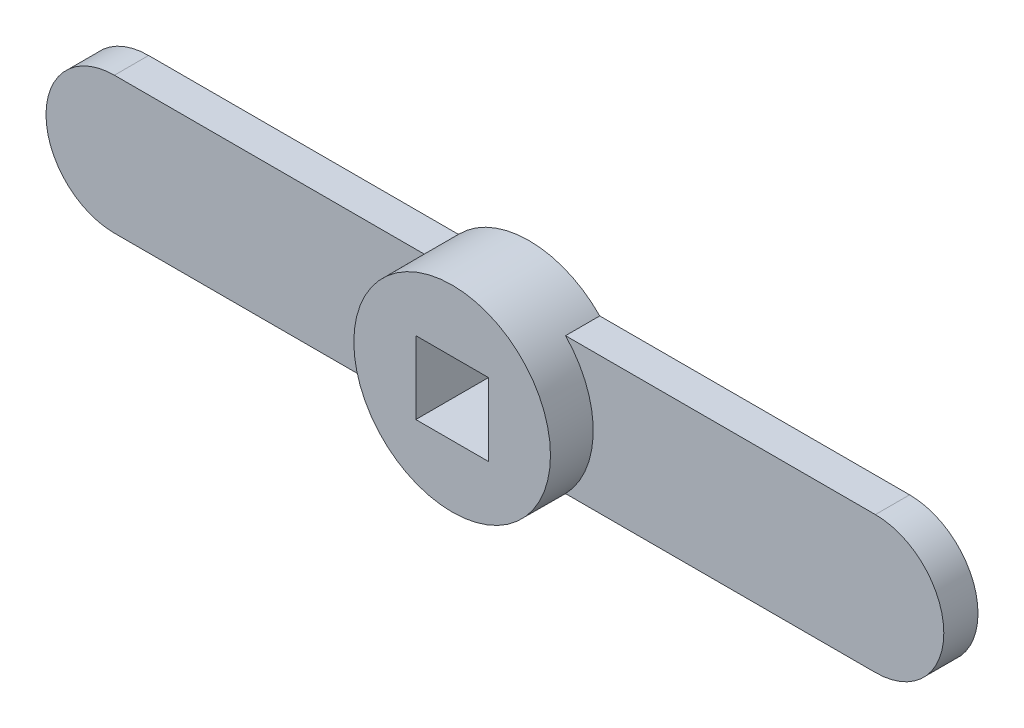
ISO-10303-21;
HEADER;
FILE_DESCRIPTION(('STEP AP214'),'2;1');
FILE_NAME('part.step','',(''),(''),'','','');
FILE_SCHEMA(('AUTOMOTIVE_DESIGN { 1 0 10303 214 1 1 1 1 }'));
ENDSEC;
DATA;
#1=APPLICATION_CONTEXT('core data for automotive mechanical design processes');
#2=APPLICATION_PROTOCOL_DEFINITION('international standard','automotive_design',2000,#1);
#3=PRODUCT_CONTEXT('',#1,'mechanical');
#4=PRODUCT('Part','Part','',(#3));
#5=PRODUCT_RELATED_PRODUCT_CATEGORY('part','',(#4));
#6=PRODUCT_DEFINITION_FORMATION('','',#4);
#7=PRODUCT_DEFINITION_CONTEXT('part definition',#1,'design');
#8=PRODUCT_DEFINITION('design','',#6,#7);
#9=PRODUCT_DEFINITION_SHAPE('','',#8);
#10=(LENGTH_UNIT() NAMED_UNIT(*) SI_UNIT(.MILLI.,.METRE.));
#11=(NAMED_UNIT(*) PLANE_ANGLE_UNIT() SI_UNIT($,.RADIAN.));
#12=(NAMED_UNIT(*) SI_UNIT($,.STERADIAN.) SOLID_ANGLE_UNIT());
#13=UNCERTAINTY_MEASURE_WITH_UNIT(LENGTH_MEASURE(1.E-05),#10,'distance_accuracy_value','');
#14=(GEOMETRIC_REPRESENTATION_CONTEXT(3) GLOBAL_UNCERTAINTY_ASSIGNED_CONTEXT((#13)) GLOBAL_UNIT_ASSIGNED_CONTEXT((#10,
#11,#12)) REPRESENTATION_CONTEXT('',''));
#15=CARTESIAN_POINT('',(0.,0.,0.));
#16=DIRECTION('',(0.,0.,1.));
#17=DIRECTION('',(1.,0.,0.));
#18=AXIS2_PLACEMENT_3D('',#15,#16,#17);
#19=CARTESIAN_POINT('',(-44.5000000000006,-8.00000000000008,4.));
#20=DIRECTION('',(0.,1.00000000000002,0.));
#21=DIRECTION('',(0.,0.,1.));
#22=AXIS2_PLACEMENT_3D('',#19,#20,#21);
#23=PLANE('',#22);
#24=DIRECTION('',(1.00000000000002,0.,0.));
#25=VECTOR('',#24,1.);
#26=CARTESIAN_POINT('',(-44.5000000000006,-8.00000000000008,4.));
#27=LINE('',#26,#25);
#28=CARTESIAN_POINT('',(8.26135582092915,-8.00000000000007,4.));
#29=VERTEX_POINT('',#28);
#30=CARTESIAN_POINT('',(44.5000000000007,-8.00000000000008,4.));
#31=VERTEX_POINT('',#30);
#32=EDGE_CURVE('E196',#29,#31,#27,.T.);
#33=ORIENTED_EDGE('',*,*,#32,.F.);
#34=DIRECTION('',(0.,0.,-1.));
#35=VECTOR('',#34,1.);
#36=CARTESIAN_POINT('',(8.26135582092915,-8.00000000000007,8.99999999999999));
#37=LINE('',#36,#35);
#38=CARTESIAN_POINT('',(8.26135582092916,-8.00000000000015,0.));
#39=VERTEX_POINT('',#38);
#40=EDGE_CURVE('E186',#29,#39,#37,.T.);
#41=ORIENTED_EDGE('',*,*,#40,.T.);
#42=DIRECTION('',(1.00000000000002,0.,0.));
#43=VECTOR('',#42,1.);
#44=CARTESIAN_POINT('',(-44.5000000000007,-8.00000000000015,0.));
#45=LINE('',#44,#43);
#46=CARTESIAN_POINT('',(44.5000000000001,-8.00000000000014,0.));
#47=VERTEX_POINT('',#46);
#48=EDGE_CURVE('E209',#39,#47,#45,.T.);
#49=ORIENTED_EDGE('',*,*,#48,.T.);
#50=DIRECTION('',(0.,0.,-1.));
#51=VECTOR('',#50,1.);
#52=CARTESIAN_POINT('',(44.5000000000007,-8.00000000000008,4.));
#53=LINE('',#52,#51);
#54=EDGE_CURVE('E55',#31,#47,#53,.T.);
#55=ORIENTED_EDGE('',*,*,#54,.F.);
#56=EDGE_LOOP('',(#33,#41,#49,#55));
#57=FACE_BOUND('',#56,.T.);
#58=ADVANCED_FACE('F47',(#57),#23,.F.);
#59=CARTESIAN_POINT('',(-44.5000000000006,8.00000000000023,3.99999999999935));
#60=DIRECTION('',(0.,-1.00000000000002,0.));
#61=DIRECTION('',(0.,0.,-1.));
#62=AXIS2_PLACEMENT_3D('',#59,#60,#61);
#63=PLANE('',#62);
#64=DIRECTION('',(-1.00000000000002,0.,0.));
#65=VECTOR('',#64,1.);
#66=CARTESIAN_POINT('',(-44.5000000000006,8.00000000000023,3.99999999999935));
#67=LINE('',#66,#65);
#68=CARTESIAN_POINT('',(-8.26135582092946,8.00000000000024,4.));
#69=VERTEX_POINT('',#68);
#70=CARTESIAN_POINT('',(-44.5000000000006,8.00000000000023,3.99999999999935));
#71=VERTEX_POINT('',#70);
#72=EDGE_CURVE('E203',#69,#71,#67,.T.);
#73=ORIENTED_EDGE('',*,*,#72,.F.);
#74=DIRECTION('',(0.,0.,-1.));
#75=VECTOR('',#74,1.);
#76=CARTESIAN_POINT('',(-8.26135582092948,8.00000000000025,9.00000000000001));
#77=LINE('',#76,#75);
#78=CARTESIAN_POINT('',(-8.26135582092946,8.00000000000016,0.));
#79=VERTEX_POINT('',#78);
#80=EDGE_CURVE('E188',#69,#79,#77,.T.);
#81=ORIENTED_EDGE('',*,*,#80,.T.);
#82=DIRECTION('',(-1.00000000000002,0.,0.));
#83=VECTOR('',#82,1.);
#84=CARTESIAN_POINT('',(-44.5000000000006,8.00000000000016,-6.24500451351651E-13));
#85=LINE('',#84,#83);
#86=CARTESIAN_POINT('',(-44.5000000000006,8.00000000000016,-6.24500451351651E-13));
#87=VERTEX_POINT('',#86);
#88=EDGE_CURVE('E214',#79,#87,#85,.T.);
#89=ORIENTED_EDGE('',*,*,#88,.T.);
#90=DIRECTION('',(0.,0.,-1.));
#91=VECTOR('',#90,1.);
#92=CARTESIAN_POINT('',(-44.5000000000006,8.00000000000023,3.99999999999935));
#93=LINE('',#92,#91);
#94=EDGE_CURVE('E206',#71,#87,#93,.T.);
#95=ORIENTED_EDGE('',*,*,#94,.F.);
#96=EDGE_LOOP('',(#73,#81,#89,#95));
#97=FACE_BOUND('',#96,.T.);
#98=ADVANCED_FACE('F249',(#97),#63,.F.);
#99=CARTESIAN_POINT('',(-44.5000000000006,0.,4.));
#100=DIRECTION('',(0.,0.,1.));
#101=DIRECTION('',(1.00000000000002,0.,0.));
#102=AXIS2_PLACEMENT_3D('',#99,#100,#101);
#103=PLANE('',#102);
#104=CARTESIAN_POINT('',(0.,0.,4.));
#105=DIRECTION('',(0.,0.,1.));
#106=DIRECTION('',(1.00000000000002,0.,0.));
#107=AXIS2_PLACEMENT_3D('',#104,#105,#106);
#108=CIRCLE('',#107,11.5);
#109=CARTESIAN_POINT('',(-8.26135582092946,-8.00000000000007,3.99999999999999));
#110=VERTEX_POINT('',#109);
#111=EDGE_CURVE('E183',#69,#110,#108,.T.);
#112=ORIENTED_EDGE('',*,*,#111,.F.);
#113=ORIENTED_EDGE('',*,*,#72,.T.);
#114=CARTESIAN_POINT('',(-44.5000000000006,0.,4.));
#115=DIRECTION('',(0.,0.,1.));
#116=DIRECTION('',(1.00000000000002,0.,0.));
#117=AXIS2_PLACEMENT_3D('',#114,#115,#116);
#118=CIRCLE('',#117,8.);
#119=CARTESIAN_POINT('',(-44.5000000000006,-8.00000000000008,4.));
#120=VERTEX_POINT('',#119);
#121=EDGE_CURVE('E193',#71,#120,#118,.T.);
#122=ORIENTED_EDGE('',*,*,#121,.T.);
#123=EDGE_CURVE('E198',#120,#110,#27,.T.);
#124=ORIENTED_EDGE('',*,*,#123,.T.);
#125=EDGE_LOOP('',(#112,#113,#122,#124));
#126=FACE_BOUND('',#125,.T.);
#127=ADVANCED_FACE('F254',(#126),#103,.T.);
#128=CARTESIAN_POINT('',(-44.5000000000006,0.,4.));
#129=DIRECTION('',(0.,0.,-1.));
#130=DIRECTION('',(-1.00000000000002,0.,0.));
#131=AXIS2_PLACEMENT_3D('',#128,#129,#130);
#132=CYLINDRICAL_SURFACE('',#131,8.);
#133=CARTESIAN_POINT('',(-44.5000000000007,0.,0.));
#134=DIRECTION('',(0.,0.,1.));
#135=DIRECTION('',(1.00000000000002,0.,0.));
#136=AXIS2_PLACEMENT_3D('',#133,#134,#135);
#137=CIRCLE('',#136,8.);
#138=CARTESIAN_POINT('',(-44.5000000000007,-8.00000000000015,0.));
#139=VERTEX_POINT('',#138);
#140=EDGE_CURVE('E192',#87,#139,#137,.T.);
#141=ORIENTED_EDGE('',*,*,#140,.T.);
#142=DIRECTION('',(0.,0.,-1.));
#143=VECTOR('',#142,1.);
#144=CARTESIAN_POINT('',(-44.5000000000006,-8.00000000000008,4.));
#145=LINE('',#144,#143);
#146=EDGE_CURVE('E13',#120,#139,#145,.T.);
#147=ORIENTED_EDGE('',*,*,#146,.F.);
#148=ORIENTED_EDGE('',*,*,#121,.F.);
#149=ORIENTED_EDGE('',*,*,#94,.T.);
#150=EDGE_LOOP('',(#141,#147,#148,#149));
#151=FACE_BOUND('',#150,.T.);
#152=ADVANCED_FACE('F49',(#151),#132,.T.);
#153=CARTESIAN_POINT('',(-8.26135582092946,-8.00000000000015,0.));
#154=VERTEX_POINT('',#153);
#155=EDGE_CURVE('E210',#139,#154,#45,.T.);
#156=ORIENTED_EDGE('',*,*,#155,.T.);
#157=DIRECTION('',(0.,0.,-1.));
#158=VECTOR('',#157,1.);
#159=CARTESIAN_POINT('',(-8.26135582092948,-8.00000000000007,8.99999999999999));
#160=LINE('',#159,#158);
#161=EDGE_CURVE('E190',#154,#110,#160,.F.);
#162=ORIENTED_EDGE('',*,*,#161,.T.);
#163=ORIENTED_EDGE('',*,*,#123,.F.);
#164=ORIENTED_EDGE('',*,*,#146,.T.);
#165=EDGE_LOOP('',(#156,#162,#163,#164));
#166=FACE_BOUND('',#165,.T.);
#167=ADVANCED_FACE('F250',(#166),#23,.F.);
#168=CARTESIAN_POINT('',(44.5000000000007,0.,3.99999999999938));
#169=DIRECTION('',(0.,0.,-1.));
#170=DIRECTION('',(-1.00000000000002,0.,0.));
#171=AXIS2_PLACEMENT_3D('',#168,#169,#170);
#172=CYLINDRICAL_SURFACE('',#171,8.);
#173=CARTESIAN_POINT('',(44.5000000000001,0.,-6.24500451351651E-13));
#174=DIRECTION('',(0.,0.,1.));
#175=DIRECTION('',(1.00000000000002,0.,0.));
#176=AXIS2_PLACEMENT_3D('',#173,#174,#175);
#177=CIRCLE('',#176,8.);
#178=CARTESIAN_POINT('',(44.5000000000001,8.00000000000017,-6.24500451351651E-13));
#179=VERTEX_POINT('',#178);
#180=EDGE_CURVE('E212',#47,#179,#177,.T.);
#181=ORIENTED_EDGE('',*,*,#180,.T.);
#182=DIRECTION('',(0.,0.,-1.));
#183=VECTOR('',#182,1.);
#184=CARTESIAN_POINT('',(44.5000000000006,8.00000000000024,3.99999999999938));
#185=LINE('',#184,#183);
#186=CARTESIAN_POINT('',(44.5000000000006,8.00000000000024,3.99999999999938));
#187=VERTEX_POINT('',#186);
#188=EDGE_CURVE('E218',#187,#179,#185,.T.);
#189=ORIENTED_EDGE('',*,*,#188,.F.);
#190=CARTESIAN_POINT('',(44.5000000000007,0.,3.99999999999938));
#191=DIRECTION('',(0.,0.,1.));
#192=DIRECTION('',(1.00000000000002,0.,0.));
#193=AXIS2_PLACEMENT_3D('',#190,#191,#192);
#194=CIRCLE('',#193,8.);
#195=EDGE_CURVE('E201',#31,#187,#194,.T.);
#196=ORIENTED_EDGE('',*,*,#195,.F.);
#197=ORIENTED_EDGE('',*,*,#54,.T.);
#198=EDGE_LOOP('',(#181,#189,#196,#197));
#199=FACE_BOUND('',#198,.T.);
#200=ADVANCED_FACE('F225',(#199),#172,.T.);
#201=CARTESIAN_POINT('',(8.26135582092914,8.00000000000016,0.));
#202=VERTEX_POINT('',#201);
#203=EDGE_CURVE('E197',#179,#202,#85,.T.);
#204=ORIENTED_EDGE('',*,*,#203,.T.);
#205=DIRECTION('',(0.,0.,-1.));
#206=VECTOR('',#205,1.);
#207=CARTESIAN_POINT('',(8.26135582092913,8.00000000000024,9.00000000000001));
#208=LINE('',#207,#206);
#209=CARTESIAN_POINT('',(8.26135582092916,8.00000000000025,4.));
#210=VERTEX_POINT('',#209);
#211=EDGE_CURVE('E182',#202,#210,#208,.F.);
#212=ORIENTED_EDGE('',*,*,#211,.T.);
#213=EDGE_CURVE('E204',#187,#210,#67,.T.);
#214=ORIENTED_EDGE('',*,*,#213,.F.);
#215=ORIENTED_EDGE('',*,*,#188,.T.);
#216=EDGE_LOOP('',(#204,#212,#214,#215));
#217=FACE_BOUND('',#216,.T.);
#218=ADVANCED_FACE('F239',(#217),#63,.F.);
#219=EDGE_CURVE('E176',#29,#210,#108,.T.);
#220=ORIENTED_EDGE('',*,*,#219,.F.);
#221=ORIENTED_EDGE('',*,*,#32,.T.);
#222=ORIENTED_EDGE('',*,*,#195,.T.);
#223=ORIENTED_EDGE('',*,*,#213,.T.);
#224=EDGE_LOOP('',(#220,#221,#222,#223));
#225=FACE_BOUND('',#224,.T.);
#226=ADVANCED_FACE('F247',(#225),#103,.T.);
#227=CARTESIAN_POINT('',(-44.5000000000007,0.,0.));
#228=DIRECTION('',(0.,0.,1.));
#229=DIRECTION('',(1.00000000000002,0.,0.));
#230=AXIS2_PLACEMENT_3D('',#227,#228,#229);
#231=PLANE('',#230);
#232=DIRECTION('',(1.00000000000002,0.,0.));
#233=VECTOR('',#232,1.);
#234=CARTESIAN_POINT('',(4.24999999999999,4.25000000000009,0.));
#235=LINE('',#234,#233);
#236=CARTESIAN_POINT('',(-4.25000000000016,4.25000000000008,0.));
#237=VERTEX_POINT('',#236);
#238=CARTESIAN_POINT('',(4.24999999999999,4.25000000000009,0.));
#239=VERTEX_POINT('',#238);
#240=EDGE_CURVE('E163',#237,#239,#235,.T.);
#241=ORIENTED_EDGE('',*,*,#240,.F.);
#242=DIRECTION('',(0.,1.00000000000002,0.));
#243=VECTOR('',#242,1.);
#244=CARTESIAN_POINT('',(-4.25000000000016,-4.25000000000007,-6.24500451351651E-13));
#245=LINE('',#244,#243);
#246=CARTESIAN_POINT('',(-4.25000000000016,-4.25000000000007,-6.24500451351651E-13));
#247=VERTEX_POINT('',#246);
#248=EDGE_CURVE('E62',#247,#237,#245,.T.);
#249=ORIENTED_EDGE('',*,*,#248,.F.);
#250=DIRECTION('',(-1.00000000000002,0.,0.));
#251=VECTOR('',#250,1.);
#252=CARTESIAN_POINT('',(4.25,-4.25000000000007,-6.24500451351651E-13));
#253=LINE('',#252,#251);
#254=CARTESIAN_POINT('',(4.25,-4.25000000000007,-6.24500451351651E-13));
#255=VERTEX_POINT('',#254);
#256=EDGE_CURVE('E154',#255,#247,#253,.T.);
#257=ORIENTED_EDGE('',*,*,#256,.F.);
#258=DIRECTION('',(0.,-1.00000000000002,0.));
#259=VECTOR('',#258,1.);
#260=CARTESIAN_POINT('',(4.25,-4.25000000000007,-6.24500451351651E-13));
#261=LINE('',#260,#259);
#262=EDGE_CURVE('E157',#239,#255,#261,.T.);
#263=ORIENTED_EDGE('',*,*,#262,.F.);
#264=EDGE_LOOP('',(#241,#249,#257,#263));
#265=FACE_BOUND('',#264,.T.);
#266=ORIENTED_EDGE('',*,*,#48,.F.);
#267=CARTESIAN_POINT('',(0.,0.,0.));
#268=DIRECTION('',(0.,0.,-1.));
#269=DIRECTION('',(-1.00000000000002,0.,0.));
#270=AXIS2_PLACEMENT_3D('',#267,#268,#269);
#271=CIRCLE('',#270,11.5);
#272=EDGE_CURVE('E169',#39,#154,#271,.T.);
#273=ORIENTED_EDGE('',*,*,#272,.T.);
#274=ORIENTED_EDGE('',*,*,#155,.F.);
#275=ORIENTED_EDGE('',*,*,#140,.F.);
#276=ORIENTED_EDGE('',*,*,#88,.F.);
#277=EDGE_CURVE('E177',#79,#202,#271,.T.);
#278=ORIENTED_EDGE('',*,*,#277,.T.);
#279=ORIENTED_EDGE('',*,*,#203,.F.);
#280=ORIENTED_EDGE('',*,*,#180,.F.);
#281=EDGE_LOOP('',(#266,#273,#274,#275,#276,#278,#279,#280));
#282=FACE_BOUND('',#281,.T.);
#283=ADVANCED_FACE('F232',(#265,#282),#231,.F.);
#284=CARTESIAN_POINT('',(0.,0.,8.99999999999999));
#285=DIRECTION('',(0.,0.,-1.));
#286=DIRECTION('',(-1.00000000000002,0.,0.));
#287=AXIS2_PLACEMENT_3D('',#284,#285,#286);
#288=CYLINDRICAL_SURFACE('',#287,11.5);
#289=CARTESIAN_POINT('',(0.,0.,8.99999999999999));
#290=DIRECTION('',(0.,0.,-1.));
#291=DIRECTION('',(-1.00000000000002,0.,0.));
#292=AXIS2_PLACEMENT_3D('',#289,#290,#291);
#293=CIRCLE('',#292,11.5);
#294=CARTESIAN_POINT('',(-11.5000000000002,0.,8.99999999999999));
#295=VERTEX_POINT('',#294);
#296=EDGE_CURVE('E173',#295,#295,#293,.T.);
#297=ORIENTED_EDGE('',*,*,#296,.T.);
#298=EDGE_LOOP('',(#297));
#299=FACE_BOUND('',#298,.T.);
#300=ORIENTED_EDGE('',*,*,#161,.F.);
#301=ORIENTED_EDGE('',*,*,#272,.F.);
#302=ORIENTED_EDGE('',*,*,#40,.F.);
#303=ORIENTED_EDGE('',*,*,#219,.T.);
#304=ORIENTED_EDGE('',*,*,#211,.F.);
#305=ORIENTED_EDGE('',*,*,#277,.F.);
#306=ORIENTED_EDGE('',*,*,#80,.F.);
#307=ORIENTED_EDGE('',*,*,#111,.T.);
#308=EDGE_LOOP('',(#300,#301,#302,#303,#304,#305,#306,#307));
#309=FACE_BOUND('',#308,.T.);
#310=ADVANCED_FACE('F243',(#299,#309),#288,.T.);
#311=CARTESIAN_POINT('',(0.,0.,8.99999999999999));
#312=DIRECTION('',(0.,0.,-1.));
#313=DIRECTION('',(-1.00000000000002,0.,0.));
#314=AXIS2_PLACEMENT_3D('',#311,#312,#313);
#315=PLANE('',#314);
#316=DIRECTION('',(-1.00000000000002,0.,0.));
#317=VECTOR('',#316,1.);
#318=CARTESIAN_POINT('',(4.25,-4.25000000000008,8.99999999999938));
#319=LINE('',#318,#317);
#320=CARTESIAN_POINT('',(4.25,-4.25000000000008,8.99999999999938));
#321=VERTEX_POINT('',#320);
#322=CARTESIAN_POINT('',(-4.25000000000032,-4.25000000000007,8.99999999999938));
#323=VERTEX_POINT('',#322);
#324=EDGE_CURVE('E144',#321,#323,#319,.T.);
#325=ORIENTED_EDGE('',*,*,#324,.T.);
#326=DIRECTION('',(0.,1.00000000000002,0.));
#327=VECTOR('',#326,1.);
#328=CARTESIAN_POINT('',(-4.25000000000032,-4.25000000000007,8.99999999999938));
#329=LINE('',#328,#327);
#330=CARTESIAN_POINT('',(-4.25000000000032,4.25000000000009,8.99999999999999));
#331=VERTEX_POINT('',#330);
#332=EDGE_CURVE('E138',#323,#331,#329,.T.);
#333=ORIENTED_EDGE('',*,*,#332,.T.);
#334=DIRECTION('',(1.00000000000002,0.,0.));
#335=VECTOR('',#334,1.);
#336=CARTESIAN_POINT('',(4.24999999999999,4.25000000000009,8.99999999999999));
#337=LINE('',#336,#335);
#338=CARTESIAN_POINT('',(4.24999999999999,4.25000000000009,8.99999999999999));
#339=VERTEX_POINT('',#338);
#340=EDGE_CURVE('E147',#331,#339,#337,.T.);
#341=ORIENTED_EDGE('',*,*,#340,.T.);
#342=DIRECTION('',(0.,-1.00000000000002,0.));
#343=VECTOR('',#342,1.);
#344=CARTESIAN_POINT('',(4.25,-4.25000000000008,8.99999999999938));
#345=LINE('',#344,#343);
#346=EDGE_CURVE('E70',#339,#321,#345,.T.);
#347=ORIENTED_EDGE('',*,*,#346,.T.);
#348=EDGE_LOOP('',(#325,#333,#341,#347));
#349=FACE_BOUND('',#348,.T.);
#350=ORIENTED_EDGE('',*,*,#296,.F.);
#351=EDGE_LOOP('',(#350));
#352=FACE_BOUND('',#351,.T.);
#353=ADVANCED_FACE('F151',(#349,#352),#315,.F.);
#354=CARTESIAN_POINT('',(-4.25000000000032,-4.25000000000007,8.99999999999938));
#355=DIRECTION('',(-1.00000000000002,0.,0.));
#356=DIRECTION('',(0.,0.,1.));
#357=AXIS2_PLACEMENT_3D('',#354,#355,#356);
#358=PLANE('',#357);
#359=ORIENTED_EDGE('',*,*,#248,.T.);
#360=DIRECTION('',(0.,0.,-1.));
#361=VECTOR('',#360,1.);
#362=CARTESIAN_POINT('',(-4.25000000000032,4.25000000000009,8.99999999999999));
#363=LINE('',#362,#361);
#364=EDGE_CURVE('E134',#331,#237,#363,.T.);
#365=ORIENTED_EDGE('',*,*,#364,.F.);
#366=ORIENTED_EDGE('',*,*,#332,.F.);
#367=DIRECTION('',(0.,0.,-1.));
#368=VECTOR('',#367,1.);
#369=CARTESIAN_POINT('',(-4.25000000000032,-4.25000000000007,8.99999999999938));
#370=LINE('',#369,#368);
#371=EDGE_CURVE('E167',#323,#247,#370,.T.);
#372=ORIENTED_EDGE('',*,*,#371,.T.);
#373=EDGE_LOOP('',(#359,#365,#366,#372));
#374=FACE_BOUND('',#373,.T.);
#375=ADVANCED_FACE('F136',(#374),#358,.F.);
#376=CARTESIAN_POINT('',(4.25,-4.25000000000008,8.99999999999938));
#377=DIRECTION('',(0.,-1.00000000000002,0.));
#378=DIRECTION('',(0.,0.,-1.));
#379=AXIS2_PLACEMENT_3D('',#376,#377,#378);
#380=PLANE('',#379);
#381=ORIENTED_EDGE('',*,*,#256,.T.);
#382=ORIENTED_EDGE('',*,*,#371,.F.);
#383=ORIENTED_EDGE('',*,*,#324,.F.);
#384=DIRECTION('',(0.,0.,-1.));
#385=VECTOR('',#384,1.);
#386=CARTESIAN_POINT('',(4.25,-4.25000000000008,8.99999999999938));
#387=LINE('',#386,#385);
#388=EDGE_CURVE('E170',#321,#255,#387,.T.);
#389=ORIENTED_EDGE('',*,*,#388,.T.);
#390=EDGE_LOOP('',(#381,#382,#383,#389));
#391=FACE_BOUND('',#390,.T.);
#392=ADVANCED_FACE('F332',(#391),#380,.F.);
#393=CARTESIAN_POINT('',(4.25,-4.25000000000008,8.99999999999938));
#394=DIRECTION('',(1.00000000000002,0.,0.));
#395=DIRECTION('',(0.,1.00000000000002,0.));
#396=AXIS2_PLACEMENT_3D('',#393,#394,#395);
#397=PLANE('',#396);
#398=ORIENTED_EDGE('',*,*,#262,.T.);
#399=ORIENTED_EDGE('',*,*,#388,.F.);
#400=ORIENTED_EDGE('',*,*,#346,.F.);
#401=DIRECTION('',(0.,0.,-1.));
#402=VECTOR('',#401,1.);
#403=CARTESIAN_POINT('',(4.24999999999999,4.25000000000009,8.99999999999999));
#404=LINE('',#403,#402);
#405=EDGE_CURVE('E143',#339,#239,#404,.T.);
#406=ORIENTED_EDGE('',*,*,#405,.T.);
#407=EDGE_LOOP('',(#398,#399,#400,#406));
#408=FACE_BOUND('',#407,.T.);
#409=ADVANCED_FACE('F339',(#408),#397,.F.);
#410=CARTESIAN_POINT('',(4.24999999999999,4.25000000000009,8.99999999999999));
#411=DIRECTION('',(0.,1.00000000000002,0.));
#412=DIRECTION('',(0.,0.,1.));
#413=AXIS2_PLACEMENT_3D('',#410,#411,#412);
#414=PLANE('',#413);
#415=ORIENTED_EDGE('',*,*,#240,.T.);
#416=ORIENTED_EDGE('',*,*,#405,.F.);
#417=ORIENTED_EDGE('',*,*,#340,.F.);
#418=ORIENTED_EDGE('',*,*,#364,.T.);
#419=EDGE_LOOP('',(#415,#416,#417,#418));
#420=FACE_BOUND('',#419,.T.);
#421=ADVANCED_FACE('F148',(#420),#414,.F.);
#422=CLOSED_SHELL('',(#58,#98,#127,#152,#167,#200,#218,#226,#283,#310,#353,#375,#392,#409,#421));
#423=MANIFOLD_SOLID_BREP('B2',#422);
#424=ADVANCED_BREP_SHAPE_REPRESENTATION('',(#18,#423),#14);
#425=SHAPE_DEFINITION_REPRESENTATION(#9,#424);
ENDSEC;
END-ISO-10303-21;
